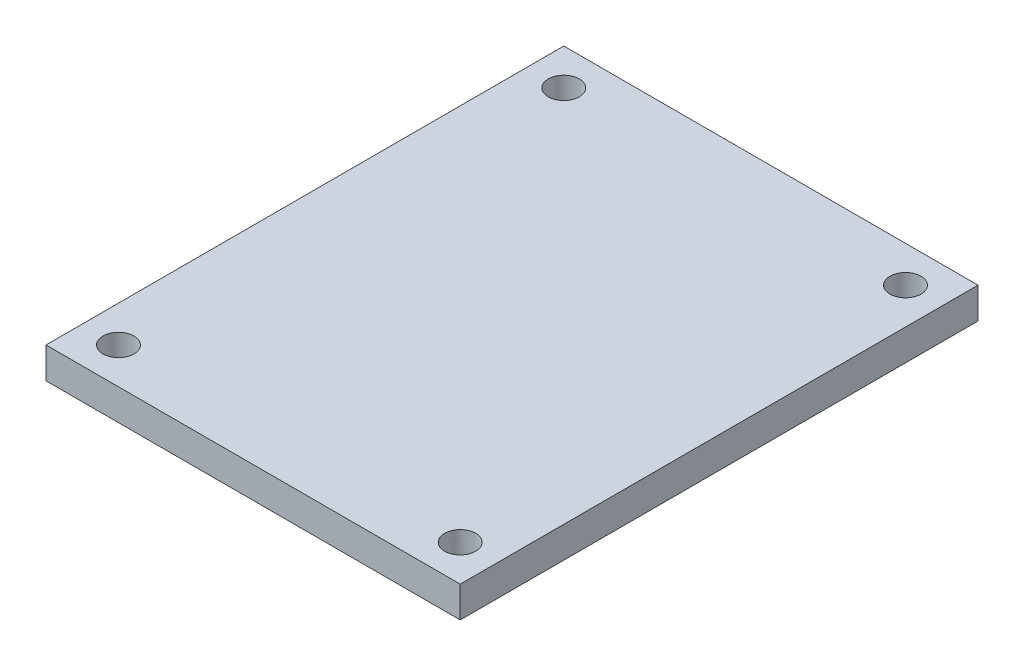
ISO-10303-21;
HEADER;
FILE_DESCRIPTION(('STEP AP214'),'2;1');
FILE_NAME('part.step','',(''),(''),'','','');
FILE_SCHEMA(('AUTOMOTIVE_DESIGN { 1 0 10303 214 1 1 1 1 }'));
ENDSEC;
DATA;
#1=APPLICATION_CONTEXT('core data for automotive mechanical design processes');
#2=APPLICATION_PROTOCOL_DEFINITION('international standard','automotive_design',2000,#1);
#3=PRODUCT_CONTEXT('',#1,'mechanical');
#4=PRODUCT('Part','Part','',(#3));
#5=PRODUCT_RELATED_PRODUCT_CATEGORY('part','',(#4));
#6=PRODUCT_DEFINITION_FORMATION('','',#4);
#7=PRODUCT_DEFINITION_CONTEXT('part definition',#1,'design');
#8=PRODUCT_DEFINITION('design','',#6,#7);
#9=PRODUCT_DEFINITION_SHAPE('','',#8);
#10=(LENGTH_UNIT() NAMED_UNIT(*) SI_UNIT(.MILLI.,.METRE.));
#11=(NAMED_UNIT(*) PLANE_ANGLE_UNIT() SI_UNIT($,.RADIAN.));
#12=(NAMED_UNIT(*) SI_UNIT($,.STERADIAN.) SOLID_ANGLE_UNIT());
#13=UNCERTAINTY_MEASURE_WITH_UNIT(LENGTH_MEASURE(1.E-05),#10,'distance_accuracy_value','');
#14=(GEOMETRIC_REPRESENTATION_CONTEXT(3) GLOBAL_UNCERTAINTY_ASSIGNED_CONTEXT((#13)) GLOBAL_UNIT_ASSIGNED_CONTEXT((#10,
#11,#12)) REPRESENTATION_CONTEXT('',''));
#15=CARTESIAN_POINT('',(0.,0.,0.));
#16=DIRECTION('',(0.,0.,1.));
#17=DIRECTION('',(1.,0.,0.));
#18=AXIS2_PLACEMENT_3D('',#15,#16,#17);
#19=CARTESIAN_POINT('',(254.,38.1,317.5));
#20=DIRECTION('',(-1.,0.,0.));
#21=DIRECTION('',(0.,0.,1.));
#22=AXIS2_PLACEMENT_3D('',#19,#20,#21);
#23=PLANE('',#22);
#24=DIRECTION('',(0.,0.,-1.));
#25=VECTOR('',#24,1.);
#26=CARTESIAN_POINT('',(254.,0.,317.5));
#27=LINE('',#26,#25);
#28=CARTESIAN_POINT('',(254.,0.,317.5));
#29=VERTEX_POINT('',#28);
#30=CARTESIAN_POINT('',(254.,0.,-317.5));
#31=VERTEX_POINT('',#30);
#32=EDGE_CURVE('E100',#29,#31,#27,.T.);
#33=ORIENTED_EDGE('',*,*,#32,.T.);
#34=DIRECTION('',(0.,-1.,0.));
#35=VECTOR('',#34,1.);
#36=CARTESIAN_POINT('',(254.,38.1,-317.5));
#37=LINE('',#36,#35);
#38=CARTESIAN_POINT('',(254.,38.1,-317.5));
#39=VERTEX_POINT('',#38);
#40=EDGE_CURVE('E11',#39,#31,#37,.T.);
#41=ORIENTED_EDGE('',*,*,#40,.F.);
#42=DIRECTION('',(0.,0.,-1.));
#43=VECTOR('',#42,1.);
#44=CARTESIAN_POINT('',(254.,38.1,317.5));
#45=LINE('',#44,#43);
#46=CARTESIAN_POINT('',(254.,38.1,317.5));
#47=VERTEX_POINT('',#46);
#48=EDGE_CURVE('E88',#47,#39,#45,.T.);
#49=ORIENTED_EDGE('',*,*,#48,.F.);
#50=DIRECTION('',(0.,-1.,0.));
#51=VECTOR('',#50,1.);
#52=CARTESIAN_POINT('',(254.,38.1,317.5));
#53=LINE('',#52,#51);
#54=EDGE_CURVE('E96',#47,#29,#53,.T.);
#55=ORIENTED_EDGE('',*,*,#54,.T.);
#56=EDGE_LOOP('',(#33,#41,#49,#55));
#57=FACE_BOUND('',#56,.T.);
#58=ADVANCED_FACE('F37',(#57),#23,.F.);
#59=CARTESIAN_POINT('',(-254.,38.1,-317.5));
#60=DIRECTION('',(0.,0.,1.));
#61=DIRECTION('',(1.,0.,0.));
#62=AXIS2_PLACEMENT_3D('',#59,#60,#61);
#63=PLANE('',#62);
#64=DIRECTION('',(-1.,0.,0.));
#65=VECTOR('',#64,1.);
#66=CARTESIAN_POINT('',(-254.,0.,-317.5));
#67=LINE('',#66,#65);
#68=CARTESIAN_POINT('',(-254.,0.,-317.5));
#69=VERTEX_POINT('',#68);
#70=EDGE_CURVE('E92',#31,#69,#67,.T.);
#71=ORIENTED_EDGE('',*,*,#70,.T.);
#72=DIRECTION('',(0.,-1.,0.));
#73=VECTOR('',#72,1.);
#74=CARTESIAN_POINT('',(-254.,38.1,-317.5));
#75=LINE('',#74,#73);
#76=CARTESIAN_POINT('',(-254.,38.1,-317.5));
#77=VERTEX_POINT('',#76);
#78=EDGE_CURVE('E45',#77,#69,#75,.T.);
#79=ORIENTED_EDGE('',*,*,#78,.F.);
#80=DIRECTION('',(-1.,0.,0.));
#81=VECTOR('',#80,1.);
#82=CARTESIAN_POINT('',(-254.,38.1,-317.5));
#83=LINE('',#82,#81);
#84=EDGE_CURVE('E83',#39,#77,#83,.T.);
#85=ORIENTED_EDGE('',*,*,#84,.F.);
#86=ORIENTED_EDGE('',*,*,#40,.T.);
#87=EDGE_LOOP('',(#71,#79,#85,#86));
#88=FACE_BOUND('',#87,.T.);
#89=ADVANCED_FACE('F91',(#88),#63,.F.);
#90=CARTESIAN_POINT('',(-254.,38.1,317.5));
#91=DIRECTION('',(1.,0.,0.));
#92=DIRECTION('',(0.,0.,-1.));
#93=AXIS2_PLACEMENT_3D('',#90,#91,#92);
#94=PLANE('',#93);
#95=DIRECTION('',(0.,0.,1.));
#96=VECTOR('',#95,1.);
#97=CARTESIAN_POINT('',(-254.,0.,317.5));
#98=LINE('',#97,#96);
#99=CARTESIAN_POINT('',(-254.,0.,317.5));
#100=VERTEX_POINT('',#99);
#101=EDGE_CURVE('E70',#69,#100,#98,.T.);
#102=ORIENTED_EDGE('',*,*,#101,.T.);
#103=DIRECTION('',(0.,-1.,0.));
#104=VECTOR('',#103,1.);
#105=CARTESIAN_POINT('',(-254.,38.1,317.5));
#106=LINE('',#105,#104);
#107=CARTESIAN_POINT('',(-254.,38.1,317.5));
#108=VERTEX_POINT('',#107);
#109=EDGE_CURVE('E93',#108,#100,#106,.T.);
#110=ORIENTED_EDGE('',*,*,#109,.F.);
#111=DIRECTION('',(0.,0.,1.));
#112=VECTOR('',#111,1.);
#113=CARTESIAN_POINT('',(-254.,38.1,317.5));
#114=LINE('',#113,#112);
#115=EDGE_CURVE('E86',#77,#108,#114,.T.);
#116=ORIENTED_EDGE('',*,*,#115,.F.);
#117=ORIENTED_EDGE('',*,*,#78,.T.);
#118=EDGE_LOOP('',(#102,#110,#116,#117));
#119=FACE_BOUND('',#118,.T.);
#120=ADVANCED_FACE('F94',(#119),#94,.F.);
#121=CARTESIAN_POINT('',(-254.,38.1,317.5));
#122=DIRECTION('',(0.,0.,-1.));
#123=DIRECTION('',(-1.,0.,0.));
#124=AXIS2_PLACEMENT_3D('',#121,#122,#123);
#125=PLANE('',#124);
#126=DIRECTION('',(1.,0.,0.));
#127=VECTOR('',#126,1.);
#128=CARTESIAN_POINT('',(-254.,0.,317.5));
#129=LINE('',#128,#127);
#130=EDGE_CURVE('E76',#100,#29,#129,.T.);
#131=ORIENTED_EDGE('',*,*,#130,.T.);
#132=ORIENTED_EDGE('',*,*,#54,.F.);
#133=DIRECTION('',(1.,0.,0.));
#134=VECTOR('',#133,1.);
#135=CARTESIAN_POINT('',(-254.,38.1,317.5));
#136=LINE('',#135,#134);
#137=EDGE_CURVE('E53',#108,#47,#136,.T.);
#138=ORIENTED_EDGE('',*,*,#137,.F.);
#139=ORIENTED_EDGE('',*,*,#109,.T.);
#140=EDGE_LOOP('',(#131,#132,#138,#139));
#141=FACE_BOUND('',#140,.T.);
#142=ADVANCED_FACE('F108',(#141),#125,.F.);
#143=CARTESIAN_POINT('',(0.,38.1,0.));
#144=DIRECTION('',(0.,-1.,0.));
#145=DIRECTION('',(0.,0.,-1.));
#146=AXIS2_PLACEMENT_3D('',#143,#144,#145);
#147=PLANE('',#146);
#148=CARTESIAN_POINT('',(209.55,38.1,-273.05));
#149=DIRECTION('',(0.,1.,0.));
#150=DIRECTION('',(0.,0.,-1.));
#151=AXIS2_PLACEMENT_3D('',#148,#149,#150);
#152=CIRCLE('',#151,19.05);
#153=CARTESIAN_POINT('',(209.55,38.1,-292.1));
#154=VERTEX_POINT('',#153);
#155=EDGE_CURVE('E130',#154,#154,#152,.T.);
#156=ORIENTED_EDGE('',*,*,#155,.F.);
#157=EDGE_LOOP('',(#156));
#158=FACE_BOUND('',#157,.T.);
#159=CARTESIAN_POINT('',(209.55,38.1,273.05));
#160=DIRECTION('',(0.,1.,0.));
#161=DIRECTION('',(0.,0.,1.));
#162=AXIS2_PLACEMENT_3D('',#159,#160,#161);
#163=CIRCLE('',#162,19.05);
#164=CARTESIAN_POINT('',(209.55,38.1,292.1));
#165=VERTEX_POINT('',#164);
#166=EDGE_CURVE('E123',#165,#165,#163,.T.);
#167=ORIENTED_EDGE('',*,*,#166,.F.);
#168=EDGE_LOOP('',(#167));
#169=FACE_BOUND('',#168,.T.);
#170=CARTESIAN_POINT('',(-209.55,38.1,273.05));
#171=DIRECTION('',(0.,1.,0.));
#172=DIRECTION('',(0.,0.,-1.));
#173=AXIS2_PLACEMENT_3D('',#170,#171,#172);
#174=CIRCLE('',#173,19.05);
#175=CARTESIAN_POINT('',(-209.55,38.1,254.));
#176=VERTEX_POINT('',#175);
#177=EDGE_CURVE('E124',#176,#176,#174,.T.);
#178=ORIENTED_EDGE('',*,*,#177,.F.);
#179=EDGE_LOOP('',(#178));
#180=FACE_BOUND('',#179,.T.);
#181=CARTESIAN_POINT('',(-209.55,38.1,-273.05));
#182=DIRECTION('',(0.,1.,0.));
#183=DIRECTION('',(0.,0.,1.));
#184=AXIS2_PLACEMENT_3D('',#181,#182,#183);
#185=CIRCLE('',#184,19.05);
#186=CARTESIAN_POINT('',(-209.55,38.1,-254.));
#187=VERTEX_POINT('',#186);
#188=EDGE_CURVE('E116',#187,#187,#185,.T.);
#189=ORIENTED_EDGE('',*,*,#188,.F.);
#190=EDGE_LOOP('',(#189));
#191=FACE_BOUND('',#190,.T.);
#192=ORIENTED_EDGE('',*,*,#48,.T.);
#193=ORIENTED_EDGE('',*,*,#84,.T.);
#194=ORIENTED_EDGE('',*,*,#115,.T.);
#195=ORIENTED_EDGE('',*,*,#137,.T.);
#196=EDGE_LOOP('',(#192,#193,#194,#195));
#197=FACE_BOUND('',#196,.T.);
#198=ADVANCED_FACE('F84',(#158,#169,#180,#191,#197),#147,.F.);
#199=CARTESIAN_POINT('',(0.,0.,0.));
#200=DIRECTION('',(0.,-1.,0.));
#201=DIRECTION('',(0.,0.,-1.));
#202=AXIS2_PLACEMENT_3D('',#199,#200,#201);
#203=PLANE('',#202);
#204=CARTESIAN_POINT('',(209.55,0.,-273.05));
#205=DIRECTION('',(0.,-1.,0.));
#206=DIRECTION('',(0.,0.,-1.));
#207=AXIS2_PLACEMENT_3D('',#204,#205,#206);
#208=CIRCLE('',#207,19.05);
#209=CARTESIAN_POINT('',(209.55,0.,-292.1));
#210=VERTEX_POINT('',#209);
#211=EDGE_CURVE('E119',#210,#210,#208,.F.);
#212=ORIENTED_EDGE('',*,*,#211,.T.);
#213=EDGE_LOOP('',(#212));
#214=FACE_BOUND('',#213,.T.);
#215=CARTESIAN_POINT('',(209.55,0.,273.05));
#216=DIRECTION('',(0.,-1.,0.));
#217=DIRECTION('',(0.,0.,-1.));
#218=AXIS2_PLACEMENT_3D('',#215,#216,#217);
#219=CIRCLE('',#218,19.05);
#220=CARTESIAN_POINT('',(209.55,0.,254.));
#221=VERTEX_POINT('',#220);
#222=EDGE_CURVE('E127',#221,#221,#219,.F.);
#223=ORIENTED_EDGE('',*,*,#222,.T.);
#224=EDGE_LOOP('',(#223));
#225=FACE_BOUND('',#224,.T.);
#226=CARTESIAN_POINT('',(-209.55,0.,273.05));
#227=DIRECTION('',(0.,-1.,0.));
#228=DIRECTION('',(0.,0.,-1.));
#229=AXIS2_PLACEMENT_3D('',#226,#227,#228);
#230=CIRCLE('',#229,19.05);
#231=CARTESIAN_POINT('',(-209.55,0.,254.));
#232=VERTEX_POINT('',#231);
#233=EDGE_CURVE('E120',#232,#232,#230,.F.);
#234=ORIENTED_EDGE('',*,*,#233,.T.);
#235=EDGE_LOOP('',(#234));
#236=FACE_BOUND('',#235,.T.);
#237=CARTESIAN_POINT('',(-209.55,0.,-273.05));
#238=DIRECTION('',(0.,-1.,0.));
#239=DIRECTION('',(0.,0.,-1.));
#240=AXIS2_PLACEMENT_3D('',#237,#238,#239);
#241=CIRCLE('',#240,19.05);
#242=CARTESIAN_POINT('',(-209.55,0.,-292.1));
#243=VERTEX_POINT('',#242);
#244=EDGE_CURVE('E103',#243,#243,#241,.F.);
#245=ORIENTED_EDGE('',*,*,#244,.T.);
#246=EDGE_LOOP('',(#245));
#247=FACE_BOUND('',#246,.T.);
#248=ORIENTED_EDGE('',*,*,#32,.F.);
#249=ORIENTED_EDGE('',*,*,#130,.F.);
#250=ORIENTED_EDGE('',*,*,#101,.F.);
#251=ORIENTED_EDGE('',*,*,#70,.F.);
#252=EDGE_LOOP('',(#248,#249,#250,#251));
#253=FACE_BOUND('',#252,.T.);
#254=ADVANCED_FACE('F111',(#214,#225,#236,#247,#253),#203,.T.);
#255=CARTESIAN_POINT('',(-209.55,-53.881536726415,-273.05));
#256=DIRECTION('',(0.,1.,0.));
#257=DIRECTION('',(0.,0.,1.));
#258=AXIS2_PLACEMENT_3D('',#255,#256,#257);
#259=CYLINDRICAL_SURFACE('',#258,19.05);
#260=ORIENTED_EDGE('',*,*,#188,.T.);
#261=EDGE_LOOP('',(#260));
#262=FACE_BOUND('',#261,.T.);
#263=ORIENTED_EDGE('',*,*,#244,.F.);
#264=EDGE_LOOP('',(#263));
#265=FACE_BOUND('',#264,.T.);
#266=ADVANCED_FACE('F150',(#262,#265),#259,.F.);
#267=CARTESIAN_POINT('',(-209.55,-53.881536726415,273.05));
#268=DIRECTION('',(0.,1.,0.));
#269=DIRECTION('',(0.,0.,1.));
#270=AXIS2_PLACEMENT_3D('',#267,#268,#269);
#271=CYLINDRICAL_SURFACE('',#270,19.05);
#272=ORIENTED_EDGE('',*,*,#177,.T.);
#273=EDGE_LOOP('',(#272));
#274=FACE_BOUND('',#273,.T.);
#275=ORIENTED_EDGE('',*,*,#233,.F.);
#276=EDGE_LOOP('',(#275));
#277=FACE_BOUND('',#276,.T.);
#278=ADVANCED_FACE('F153',(#274,#277),#271,.F.);
#279=CARTESIAN_POINT('',(209.55,-53.881536726415,273.05));
#280=DIRECTION('',(0.,1.,0.));
#281=DIRECTION('',(0.,0.,1.));
#282=AXIS2_PLACEMENT_3D('',#279,#280,#281);
#283=CYLINDRICAL_SURFACE('',#282,19.05);
#284=ORIENTED_EDGE('',*,*,#166,.T.);
#285=EDGE_LOOP('',(#284));
#286=FACE_BOUND('',#285,.T.);
#287=ORIENTED_EDGE('',*,*,#222,.F.);
#288=EDGE_LOOP('',(#287));
#289=FACE_BOUND('',#288,.T.);
#290=ADVANCED_FACE('F200',(#286,#289),#283,.F.);
#291=CARTESIAN_POINT('',(209.55,-53.881536726415,-273.05));
#292=DIRECTION('',(0.,1.,0.));
#293=DIRECTION('',(0.,0.,1.));
#294=AXIS2_PLACEMENT_3D('',#291,#292,#293);
#295=CYLINDRICAL_SURFACE('',#294,19.05);
#296=ORIENTED_EDGE('',*,*,#155,.T.);
#297=EDGE_LOOP('',(#296));
#298=FACE_BOUND('',#297,.T.);
#299=ORIENTED_EDGE('',*,*,#211,.F.);
#300=EDGE_LOOP('',(#299));
#301=FACE_BOUND('',#300,.T.);
#302=ADVANCED_FACE('F138',(#298,#301),#295,.F.);
#303=CLOSED_SHELL('',(#58,#89,#120,#142,#198,#254,#266,#278,#290,#302));
#304=MANIFOLD_SOLID_BREP('B2',#303);
#305=ADVANCED_BREP_SHAPE_REPRESENTATION('',(#18,#304),#14);
#306=SHAPE_DEFINITION_REPRESENTATION(#9,#305);
ENDSEC;
END-ISO-10303-21;
